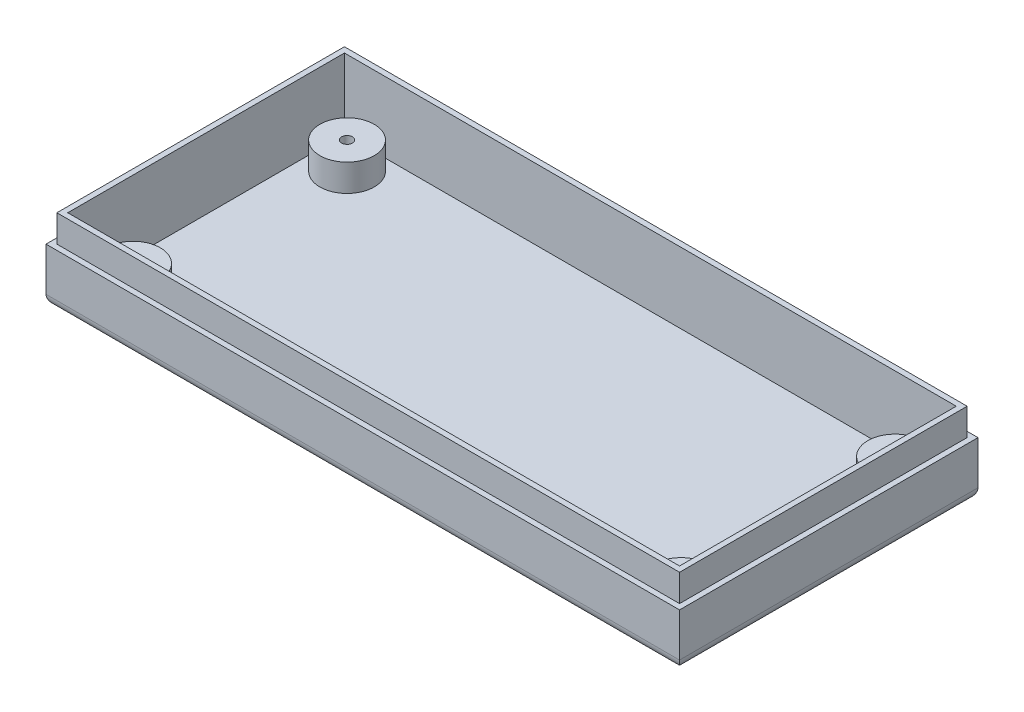
ISO-10303-21;
HEADER;
FILE_DESCRIPTION(('STEP AP214'),'2;1');
FILE_NAME('part.step','',(''),(''),'','','');
FILE_SCHEMA(('AUTOMOTIVE_DESIGN { 1 0 10303 214 1 1 1 1 }'));
ENDSEC;
DATA;
#1=APPLICATION_CONTEXT('core data for automotive mechanical design processes');
#2=APPLICATION_PROTOCOL_DEFINITION('international standard','automotive_design',2000,#1);
#3=PRODUCT_CONTEXT('',#1,'mechanical');
#4=PRODUCT('Part','Part','',(#3));
#5=PRODUCT_RELATED_PRODUCT_CATEGORY('part','',(#4));
#6=PRODUCT_DEFINITION_FORMATION('','',#4);
#7=PRODUCT_DEFINITION_CONTEXT('part definition',#1,'design');
#8=PRODUCT_DEFINITION('design','',#6,#7);
#9=PRODUCT_DEFINITION_SHAPE('','',#8);
#10=(LENGTH_UNIT() NAMED_UNIT(*) SI_UNIT(.MILLI.,.METRE.));
#11=(NAMED_UNIT(*) PLANE_ANGLE_UNIT() SI_UNIT($,.RADIAN.));
#12=(NAMED_UNIT(*) SI_UNIT($,.STERADIAN.) SOLID_ANGLE_UNIT());
#13=UNCERTAINTY_MEASURE_WITH_UNIT(LENGTH_MEASURE(1.E-05),#10,'distance_accuracy_value','');
#14=(GEOMETRIC_REPRESENTATION_CONTEXT(3) GLOBAL_UNCERTAINTY_ASSIGNED_CONTEXT((#13)) GLOBAL_UNIT_ASSIGNED_CONTEXT((#10,
#11,#12)) REPRESENTATION_CONTEXT('',''));
#15=CARTESIAN_POINT('',(0.,0.,0.));
#16=DIRECTION('',(0.,0.,1.));
#17=DIRECTION('',(1.,0.,0.));
#18=AXIS2_PLACEMENT_3D('',#15,#16,#17);
#19=CARTESIAN_POINT('',(-86.7417085427136,10.,-16.7634503002109));
#20=DIRECTION('',(1.,0.,0.));
#21=DIRECTION('',(0.,0.,-1.));
#22=AXIS2_PLACEMENT_3D('',#19,#20,#21);
#23=PLANE('',#22);
#24=DIRECTION('',(0.,-1.,0.));
#25=VECTOR('',#24,1.);
#26=CARTESIAN_POINT('',(-86.7417085427136,10.,-14.7634503002109));
#27=LINE('',#26,#25);
#28=CARTESIAN_POINT('',(-86.7417085427136,15.,-14.7634503002109));
#29=VERTEX_POINT('',#28);
#30=CARTESIAN_POINT('',(-86.7417085427136,2.,-14.7634503002109));
#31=VERTEX_POINT('',#30);
#32=EDGE_CURVE('E187',#29,#31,#27,.T.);
#33=ORIENTED_EDGE('',*,*,#32,.F.);
#34=DIRECTION('',(0.,0.,1.));
#35=VECTOR('',#34,1.);
#36=CARTESIAN_POINT('',(-86.7417085427136,15.,-14.7634503002109));
#37=LINE('',#36,#35);
#38=CARTESIAN_POINT('',(-86.7417085427136,15.,36.1615218951902));
#39=VERTEX_POINT('',#38);
#40=EDGE_CURVE('E190',#29,#39,#37,.T.);
#41=ORIENTED_EDGE('',*,*,#40,.T.);
#42=DIRECTION('',(0.,-1.,0.));
#43=VECTOR('',#42,1.);
#44=CARTESIAN_POINT('',(-86.7417085427136,10.,36.1615218951902));
#45=LINE('',#44,#43);
#46=CARTESIAN_POINT('',(-86.7417085427136,2.,36.1615218951902));
#47=VERTEX_POINT('',#46);
#48=EDGE_CURVE('E102',#39,#47,#45,.T.);
#49=ORIENTED_EDGE('',*,*,#48,.T.);
#50=DIRECTION('',(0.,0.,-1.));
#51=VECTOR('',#50,1.);
#52=CARTESIAN_POINT('',(-86.7417085427136,2.,0.));
#53=LINE('',#52,#51);
#54=EDGE_CURVE('E315',#47,#31,#53,.T.);
#55=ORIENTED_EDGE('',*,*,#54,.T.);
#56=EDGE_LOOP('',(#33,#41,#49,#55));
#57=FACE_BOUND('',#56,.T.);
#58=ADVANCED_FACE('F63',(#57),#23,.T.);
#59=CARTESIAN_POINT('',(-88.7417085427136,10.,36.1615218951902));
#60=DIRECTION('',(0.,0.,-1.));
#61=DIRECTION('',(-1.,0.,0.));
#62=AXIS2_PLACEMENT_3D('',#59,#60,#61);
#63=PLANE('',#62);
#64=ORIENTED_EDGE('',*,*,#48,.F.);
#65=DIRECTION('',(1.,0.,0.));
#66=VECTOR('',#65,1.);
#67=CARTESIAN_POINT('',(-86.7417085427136,15.,36.1615218951902));
#68=LINE('',#67,#66);
#69=CARTESIAN_POINT('',(25.8557219457893,15.,36.1615218951902));
#70=VERTEX_POINT('',#69);
#71=EDGE_CURVE('E183',#39,#70,#68,.T.);
#72=ORIENTED_EDGE('',*,*,#71,.T.);
#73=DIRECTION('',(0.,-1.,0.));
#74=VECTOR('',#73,1.);
#75=CARTESIAN_POINT('',(25.8557219457893,10.,36.1615218951902));
#76=LINE('',#75,#74);
#77=CARTESIAN_POINT('',(25.8557219457893,2.,36.1615218951902));
#78=VERTEX_POINT('',#77);
#79=EDGE_CURVE('E320',#70,#78,#76,.T.);
#80=ORIENTED_EDGE('',*,*,#79,.T.);
#81=DIRECTION('',(1.,0.,0.));
#82=VECTOR('',#81,1.);
#83=CARTESIAN_POINT('',(-88.7417085427136,2.,36.1615218951902));
#84=LINE('',#83,#82);
#85=EDGE_CURVE('E186',#47,#78,#84,.T.);
#86=ORIENTED_EDGE('',*,*,#85,.F.);
#87=EDGE_LOOP('',(#64,#72,#80,#86));
#88=FACE_BOUND('',#87,.T.);
#89=ADVANCED_FACE('F181',(#88),#63,.T.);
#90=CARTESIAN_POINT('',(25.8557219457893,10.,-16.7634503002109));
#91=DIRECTION('',(-1.,0.,0.));
#92=DIRECTION('',(0.,0.,1.));
#93=AXIS2_PLACEMENT_3D('',#90,#91,#92);
#94=PLANE('',#93);
#95=ORIENTED_EDGE('',*,*,#79,.F.);
#96=DIRECTION('',(0.,0.,-1.));
#97=VECTOR('',#96,1.);
#98=CARTESIAN_POINT('',(25.8557219457893,15.,-14.7634503002109));
#99=LINE('',#98,#97);
#100=CARTESIAN_POINT('',(25.8557219457893,15.,-14.7634503002109));
#101=VERTEX_POINT('',#100);
#102=EDGE_CURVE('E197',#70,#101,#99,.T.);
#103=ORIENTED_EDGE('',*,*,#102,.T.);
#104=DIRECTION('',(0.,-1.,0.));
#105=VECTOR('',#104,1.);
#106=CARTESIAN_POINT('',(25.8557219457893,10.,-14.7634503002109));
#107=LINE('',#106,#105);
#108=CARTESIAN_POINT('',(25.8557219457893,2.,-14.7634503002109));
#109=VERTEX_POINT('',#108);
#110=EDGE_CURVE('E317',#101,#109,#107,.T.);
#111=ORIENTED_EDGE('',*,*,#110,.T.);
#112=DIRECTION('',(0.,0.,1.));
#113=VECTOR('',#112,1.);
#114=CARTESIAN_POINT('',(25.8557219457893,2.,0.));
#115=LINE('',#114,#113);
#116=EDGE_CURVE('E310',#109,#78,#115,.T.);
#117=ORIENTED_EDGE('',*,*,#116,.T.);
#118=EDGE_LOOP('',(#95,#103,#111,#117));
#119=FACE_BOUND('',#118,.T.);
#120=ADVANCED_FACE('F361',(#119),#94,.T.);
#121=CARTESIAN_POINT('',(-88.7417085427136,10.,-14.7634503002109));
#122=DIRECTION('',(0.,0.,1.));
#123=DIRECTION('',(1.,0.,0.));
#124=AXIS2_PLACEMENT_3D('',#121,#122,#123);
#125=PLANE('',#124);
#126=ORIENTED_EDGE('',*,*,#110,.F.);
#127=DIRECTION('',(-1.,0.,0.));
#128=VECTOR('',#127,1.);
#129=CARTESIAN_POINT('',(-86.7417085427136,15.,-14.7634503002109));
#130=LINE('',#129,#128);
#131=EDGE_CURVE('E199',#101,#29,#130,.T.);
#132=ORIENTED_EDGE('',*,*,#131,.T.);
#133=ORIENTED_EDGE('',*,*,#32,.T.);
#134=DIRECTION('',(1.,0.,0.));
#135=VECTOR('',#134,1.);
#136=CARTESIAN_POINT('',(0.,2.,-14.7634503002109));
#137=LINE('',#136,#135);
#138=EDGE_CURVE('E87',#31,#109,#137,.T.);
#139=ORIENTED_EDGE('',*,*,#138,.T.);
#140=EDGE_LOOP('',(#126,#132,#133,#139));
#141=FACE_BOUND('',#140,.T.);
#142=ADVANCED_FACE('F368',(#141),#125,.T.);
#143=CARTESIAN_POINT('',(0.,2.,0.));
#144=DIRECTION('',(0.,1.,0.));
#145=DIRECTION('',(0.,0.,1.));
#146=AXIS2_PLACEMENT_3D('',#143,#144,#145);
#147=PLANE('',#146);
#148=CARTESIAN_POINT('',(-80.6418336659376,2.,-9.1439824613833));
#149=DIRECTION('',(0.,1.,0.));
#150=DIRECTION('',(0.,0.,1.));
#151=AXIS2_PLACEMENT_3D('',#148,#149,#150);
#152=CIRCLE('',#151,5.);
#153=CARTESIAN_POINT('',(-80.6418336659376,2.,-4.14398246138329));
#154=VERTEX_POINT('',#153);
#155=EDGE_CURVE('E231',#154,#154,#152,.T.);
#156=ORIENTED_EDGE('',*,*,#155,.F.);
#157=EDGE_LOOP('',(#156));
#158=FACE_BOUND('',#157,.T.);
#159=CARTESIAN_POINT('',(20.1981663340624,2.,-9.1439824613833));
#160=DIRECTION('',(0.,1.,0.));
#161=DIRECTION('',(0.,0.,1.));
#162=AXIS2_PLACEMENT_3D('',#159,#160,#161);
#163=CIRCLE('',#162,5.);
#164=CARTESIAN_POINT('',(20.1981663340624,2.,-4.14398246138329));
#165=VERTEX_POINT('',#164);
#166=EDGE_CURVE('E240',#165,#165,#163,.T.);
#167=ORIENTED_EDGE('',*,*,#166,.F.);
#168=EDGE_LOOP('',(#167));
#169=FACE_BOUND('',#168,.T.);
#170=CARTESIAN_POINT('',(20.1981663340624,2.,30.2260175386167));
#171=DIRECTION('',(0.,1.,0.));
#172=DIRECTION('',(0.,0.,1.));
#173=AXIS2_PLACEMENT_3D('',#170,#171,#172);
#174=CIRCLE('',#173,5.);
#175=CARTESIAN_POINT('',(20.1981663340624,2.,35.2260175386167));
#176=VERTEX_POINT('',#175);
#177=EDGE_CURVE('E249',#176,#176,#174,.T.);
#178=ORIENTED_EDGE('',*,*,#177,.F.);
#179=EDGE_LOOP('',(#178));
#180=FACE_BOUND('',#179,.T.);
#181=CARTESIAN_POINT('',(-80.6418336659376,2.,30.2260175386167));
#182=DIRECTION('',(0.,1.,0.));
#183=DIRECTION('',(0.,0.,1.));
#184=AXIS2_PLACEMENT_3D('',#181,#182,#183);
#185=CIRCLE('',#184,5.);
#186=CARTESIAN_POINT('',(-80.6418336659376,2.,35.2260175386167));
#187=VERTEX_POINT('',#186);
#188=EDGE_CURVE('E260',#187,#187,#185,.T.);
#189=ORIENTED_EDGE('',*,*,#188,.F.);
#190=EDGE_LOOP('',(#189));
#191=FACE_BOUND('',#190,.T.);
#192=ORIENTED_EDGE('',*,*,#85,.T.);
#193=ORIENTED_EDGE('',*,*,#116,.F.);
#194=ORIENTED_EDGE('',*,*,#138,.F.);
#195=ORIENTED_EDGE('',*,*,#54,.F.);
#196=EDGE_LOOP('',(#192,#193,#194,#195));
#197=FACE_BOUND('',#196,.T.);
#198=ADVANCED_FACE('F65',(#158,#169,#180,#191,#197),#147,.T.);
#199=CARTESIAN_POINT('',(-80.6418336659376,7.,30.2260175386167));
#200=DIRECTION('',(0.,1.,0.));
#201=DIRECTION('',(0.,0.,1.));
#202=AXIS2_PLACEMENT_3D('',#199,#200,#201);
#203=PLANE('',#202);
#204=CARTESIAN_POINT('',(-80.6418336659376,7.,30.2260175386167));
#205=DIRECTION('',(0.,1.,0.));
#206=DIRECTION('',(0.,0.,1.));
#207=AXIS2_PLACEMENT_3D('',#204,#205,#206);
#208=CIRCLE('',#207,5.);
#209=CARTESIAN_POINT('',(-80.6418336659376,7.,35.2260175386167));
#210=VERTEX_POINT('',#209);
#211=EDGE_CURVE('E261',#210,#210,#208,.T.);
#212=ORIENTED_EDGE('',*,*,#211,.T.);
#213=EDGE_LOOP('',(#212));
#214=FACE_BOUND('',#213,.T.);
#215=CARTESIAN_POINT('',(-80.6418336659376,7.,30.2260175386167));
#216=DIRECTION('',(0.,1.,0.));
#217=DIRECTION('',(0.,0.,1.));
#218=AXIS2_PLACEMENT_3D('',#215,#216,#217);
#219=CIRCLE('',#218,0.999999999999998);
#220=CARTESIAN_POINT('',(-80.6418336659376,7.,31.2260175386167));
#221=VERTEX_POINT('',#220);
#222=EDGE_CURVE('E257',#221,#221,#219,.T.);
#223=ORIENTED_EDGE('',*,*,#222,.F.);
#224=EDGE_LOOP('',(#223));
#225=FACE_BOUND('',#224,.T.);
#226=ADVANCED_FACE('F374',(#214,#225),#203,.T.);
#227=CARTESIAN_POINT('',(-80.6418336659376,7.,30.2260175386167));
#228=DIRECTION('',(0.,-1.,0.));
#229=DIRECTION('',(0.,0.,-1.));
#230=AXIS2_PLACEMENT_3D('',#227,#228,#229);
#231=CYLINDRICAL_SURFACE('',#230,5.);
#232=ORIENTED_EDGE('',*,*,#211,.F.);
#233=EDGE_LOOP('',(#232));
#234=FACE_BOUND('',#233,.T.);
#235=ORIENTED_EDGE('',*,*,#188,.T.);
#236=EDGE_LOOP('',(#235));
#237=FACE_BOUND('',#236,.T.);
#238=ADVANCED_FACE('F380',(#234,#237),#231,.T.);
#239=CARTESIAN_POINT('',(-80.6418336659376,7.,30.2260175386167));
#240=DIRECTION('',(0.,-1.,0.));
#241=DIRECTION('',(0.,0.,-1.));
#242=AXIS2_PLACEMENT_3D('',#239,#240,#241);
#243=CYLINDRICAL_SURFACE('',#242,0.999999999999998);
#244=ORIENTED_EDGE('',*,*,#222,.T.);
#245=EDGE_LOOP('',(#244));
#246=FACE_BOUND('',#245,.T.);
#247=CARTESIAN_POINT('',(-80.6418336659376,2.,30.2260175386167));
#248=DIRECTION('',(0.,1.,0.));
#249=DIRECTION('',(0.,0.,1.));
#250=AXIS2_PLACEMENT_3D('',#247,#248,#249);
#251=CIRCLE('',#250,0.999999999999998);
#252=CARTESIAN_POINT('',(-80.6418336659376,2.,31.2260175386167));
#253=VERTEX_POINT('',#252);
#254=EDGE_CURVE('E313',#253,#253,#251,.F.);
#255=ORIENTED_EDGE('',*,*,#254,.T.);
#256=EDGE_LOOP('',(#255));
#257=FACE_BOUND('',#256,.T.);
#258=ADVANCED_FACE('F387',(#246,#257),#243,.F.);
#259=ORIENTED_EDGE('',*,*,#254,.F.);
#260=EDGE_LOOP('',(#259));
#261=FACE_BOUND('',#260,.T.);
#262=ADVANCED_FACE('F352',(#261),#147,.T.);
#263=CARTESIAN_POINT('',(20.1981663340624,7.,30.2260175386167));
#264=DIRECTION('',(0.,1.,0.));
#265=DIRECTION('',(0.,0.,1.));
#266=AXIS2_PLACEMENT_3D('',#263,#264,#265);
#267=PLANE('',#266);
#268=CARTESIAN_POINT('',(20.1981663340624,7.,30.2260175386167));
#269=DIRECTION('',(0.,1.,0.));
#270=DIRECTION('',(0.,0.,1.));
#271=AXIS2_PLACEMENT_3D('',#268,#269,#270);
#272=CIRCLE('',#271,5.);
#273=CARTESIAN_POINT('',(20.1981663340624,7.,35.2260175386167));
#274=VERTEX_POINT('',#273);
#275=EDGE_CURVE('E248',#274,#274,#272,.T.);
#276=ORIENTED_EDGE('',*,*,#275,.T.);
#277=EDGE_LOOP('',(#276));
#278=FACE_BOUND('',#277,.T.);
#279=CARTESIAN_POINT('',(20.1981663340624,7.,30.2260175386167));
#280=DIRECTION('',(0.,1.,0.));
#281=DIRECTION('',(0.,0.,1.));
#282=AXIS2_PLACEMENT_3D('',#279,#280,#281);
#283=CIRCLE('',#282,1.);
#284=CARTESIAN_POINT('',(20.1981663340624,7.,31.2260175386167));
#285=VERTEX_POINT('',#284);
#286=EDGE_CURVE('E252',#285,#285,#283,.T.);
#287=ORIENTED_EDGE('',*,*,#286,.F.);
#288=EDGE_LOOP('',(#287));
#289=FACE_BOUND('',#288,.T.);
#290=ADVANCED_FACE('F386',(#278,#289),#267,.T.);
#291=CARTESIAN_POINT('',(20.1981663340624,7.,30.2260175386167));
#292=DIRECTION('',(0.,-1.,0.));
#293=DIRECTION('',(0.,0.,-1.));
#294=AXIS2_PLACEMENT_3D('',#291,#292,#293);
#295=CYLINDRICAL_SURFACE('',#294,5.);
#296=ORIENTED_EDGE('',*,*,#275,.F.);
#297=EDGE_LOOP('',(#296));
#298=FACE_BOUND('',#297,.T.);
#299=ORIENTED_EDGE('',*,*,#177,.T.);
#300=EDGE_LOOP('',(#299));
#301=FACE_BOUND('',#300,.T.);
#302=ADVANCED_FACE('F393',(#298,#301),#295,.T.);
#303=CARTESIAN_POINT('',(20.1981663340624,7.,30.2260175386167));
#304=DIRECTION('',(0.,-1.,0.));
#305=DIRECTION('',(0.,0.,-1.));
#306=AXIS2_PLACEMENT_3D('',#303,#304,#305);
#307=CYLINDRICAL_SURFACE('',#306,1.);
#308=ORIENTED_EDGE('',*,*,#286,.T.);
#309=EDGE_LOOP('',(#308));
#310=FACE_BOUND('',#309,.T.);
#311=CARTESIAN_POINT('',(20.1981663340624,2.,30.2260175386167));
#312=DIRECTION('',(0.,1.,0.));
#313=DIRECTION('',(0.,0.,1.));
#314=AXIS2_PLACEMENT_3D('',#311,#312,#313);
#315=CIRCLE('',#314,1.);
#316=CARTESIAN_POINT('',(20.1981663340624,2.,31.2260175386167));
#317=VERTEX_POINT('',#316);
#318=EDGE_CURVE('E326',#317,#317,#315,.F.);
#319=ORIENTED_EDGE('',*,*,#318,.T.);
#320=EDGE_LOOP('',(#319));
#321=FACE_BOUND('',#320,.T.);
#322=ADVANCED_FACE('F350',(#310,#321),#307,.F.);
#323=ORIENTED_EDGE('',*,*,#318,.F.);
#324=EDGE_LOOP('',(#323));
#325=FACE_BOUND('',#324,.T.);
#326=ADVANCED_FACE('F336',(#325),#147,.T.);
#327=CARTESIAN_POINT('',(20.1981663340624,7.,-9.1439824613833));
#328=DIRECTION('',(0.,1.,0.));
#329=DIRECTION('',(0.,0.,1.));
#330=AXIS2_PLACEMENT_3D('',#327,#328,#329);
#331=PLANE('',#330);
#332=CARTESIAN_POINT('',(20.1981663340624,7.,-9.1439824613833));
#333=DIRECTION('',(0.,1.,0.));
#334=DIRECTION('',(0.,0.,1.));
#335=AXIS2_PLACEMENT_3D('',#332,#333,#334);
#336=CIRCLE('',#335,5.);
#337=CARTESIAN_POINT('',(20.1981663340624,7.,-4.14398246138329));
#338=VERTEX_POINT('',#337);
#339=EDGE_CURVE('E239',#338,#338,#336,.T.);
#340=ORIENTED_EDGE('',*,*,#339,.T.);
#341=EDGE_LOOP('',(#340));
#342=FACE_BOUND('',#341,.T.);
#343=CARTESIAN_POINT('',(20.1981663340624,7.,-9.1439824613833));
#344=DIRECTION('',(0.,1.,0.));
#345=DIRECTION('',(0.,0.,1.));
#346=AXIS2_PLACEMENT_3D('',#343,#344,#345);
#347=CIRCLE('',#346,1.);
#348=CARTESIAN_POINT('',(20.1981663340624,7.,-8.14398246138329));
#349=VERTEX_POINT('',#348);
#350=EDGE_CURVE('E243',#349,#349,#347,.T.);
#351=ORIENTED_EDGE('',*,*,#350,.F.);
#352=EDGE_LOOP('',(#351));
#353=FACE_BOUND('',#352,.T.);
#354=ADVANCED_FACE('F349',(#342,#353),#331,.T.);
#355=CARTESIAN_POINT('',(20.1981663340624,7.,-9.1439824613833));
#356=DIRECTION('',(0.,-1.,0.));
#357=DIRECTION('',(0.,0.,-1.));
#358=AXIS2_PLACEMENT_3D('',#355,#356,#357);
#359=CYLINDRICAL_SURFACE('',#358,5.);
#360=ORIENTED_EDGE('',*,*,#339,.F.);
#361=EDGE_LOOP('',(#360));
#362=FACE_BOUND('',#361,.T.);
#363=ORIENTED_EDGE('',*,*,#166,.T.);
#364=EDGE_LOOP('',(#363));
#365=FACE_BOUND('',#364,.T.);
#366=ADVANCED_FACE('F345',(#362,#365),#359,.T.);
#367=CARTESIAN_POINT('',(20.1981663340624,7.,-9.1439824613833));
#368=DIRECTION('',(0.,-1.,0.));
#369=DIRECTION('',(0.,0.,-1.));
#370=AXIS2_PLACEMENT_3D('',#367,#368,#369);
#371=CYLINDRICAL_SURFACE('',#370,1.);
#372=ORIENTED_EDGE('',*,*,#350,.T.);
#373=EDGE_LOOP('',(#372));
#374=FACE_BOUND('',#373,.T.);
#375=CARTESIAN_POINT('',(20.1981663340624,2.,-9.1439824613833));
#376=DIRECTION('',(0.,1.,0.));
#377=DIRECTION('',(0.,0.,1.));
#378=AXIS2_PLACEMENT_3D('',#375,#376,#377);
#379=CIRCLE('',#378,1.);
#380=CARTESIAN_POINT('',(20.1981663340624,2.,-8.14398246138329));
#381=VERTEX_POINT('',#380);
#382=EDGE_CURVE('E71',#381,#381,#379,.F.);
#383=ORIENTED_EDGE('',*,*,#382,.T.);
#384=EDGE_LOOP('',(#383));
#385=FACE_BOUND('',#384,.T.);
#386=ADVANCED_FACE('F331',(#374,#385),#371,.F.);
#387=ORIENTED_EDGE('',*,*,#382,.F.);
#388=EDGE_LOOP('',(#387));
#389=FACE_BOUND('',#388,.T.);
#390=ADVANCED_FACE('F333',(#389),#147,.T.);
#391=CARTESIAN_POINT('',(-80.6418336659376,7.,-9.1439824613833));
#392=DIRECTION('',(0.,1.,0.));
#393=DIRECTION('',(0.,0.,1.));
#394=AXIS2_PLACEMENT_3D('',#391,#392,#393);
#395=PLANE('',#394);
#396=CARTESIAN_POINT('',(-80.6418336659376,7.,-9.1439824613833));
#397=DIRECTION('',(0.,1.,0.));
#398=DIRECTION('',(0.,0.,1.));
#399=AXIS2_PLACEMENT_3D('',#396,#397,#398);
#400=CIRCLE('',#399,5.);
#401=CARTESIAN_POINT('',(-80.6418336659376,7.,-4.14398246138329));
#402=VERTEX_POINT('',#401);
#403=EDGE_CURVE('E230',#402,#402,#400,.T.);
#404=ORIENTED_EDGE('',*,*,#403,.T.);
#405=EDGE_LOOP('',(#404));
#406=FACE_BOUND('',#405,.T.);
#407=CARTESIAN_POINT('',(-80.6418336659376,7.,-9.1439824613833));
#408=DIRECTION('',(0.,1.,0.));
#409=DIRECTION('',(0.,0.,1.));
#410=AXIS2_PLACEMENT_3D('',#407,#408,#409);
#411=CIRCLE('',#410,0.999999999999998);
#412=CARTESIAN_POINT('',(-80.6418336659376,7.,-8.1439824613833));
#413=VERTEX_POINT('',#412);
#414=EDGE_CURVE('E234',#413,#413,#411,.T.);
#415=ORIENTED_EDGE('',*,*,#414,.F.);
#416=EDGE_LOOP('',(#415));
#417=FACE_BOUND('',#416,.T.);
#418=ADVANCED_FACE('F335',(#406,#417),#395,.T.);
#419=CARTESIAN_POINT('',(-80.6418336659376,7.,-9.1439824613833));
#420=DIRECTION('',(0.,-1.,0.));
#421=DIRECTION('',(0.,0.,-1.));
#422=AXIS2_PLACEMENT_3D('',#419,#420,#421);
#423=CYLINDRICAL_SURFACE('',#422,5.);
#424=ORIENTED_EDGE('',*,*,#403,.F.);
#425=EDGE_LOOP('',(#424));
#426=FACE_BOUND('',#425,.T.);
#427=ORIENTED_EDGE('',*,*,#155,.T.);
#428=EDGE_LOOP('',(#427));
#429=FACE_BOUND('',#428,.T.);
#430=ADVANCED_FACE('F342',(#426,#429),#423,.T.);
#431=CARTESIAN_POINT('',(-80.6418336659376,7.,-9.1439824613833));
#432=DIRECTION('',(0.,-1.,0.));
#433=DIRECTION('',(0.,0.,-1.));
#434=AXIS2_PLACEMENT_3D('',#431,#432,#433);
#435=CYLINDRICAL_SURFACE('',#434,0.999999999999998);
#436=ORIENTED_EDGE('',*,*,#414,.T.);
#437=EDGE_LOOP('',(#436));
#438=FACE_BOUND('',#437,.T.);
#439=CARTESIAN_POINT('',(-80.6418336659376,2.,-9.1439824613833));
#440=DIRECTION('',(0.,1.,0.));
#441=DIRECTION('',(0.,0.,1.));
#442=AXIS2_PLACEMENT_3D('',#439,#440,#441);
#443=CIRCLE('',#442,0.999999999999998);
#444=CARTESIAN_POINT('',(-80.6418336659376,2.,-8.1439824613833));
#445=VERTEX_POINT('',#444);
#446=EDGE_CURVE('E12',#445,#445,#443,.F.);
#447=ORIENTED_EDGE('',*,*,#446,.T.);
#448=EDGE_LOOP('',(#447));
#449=FACE_BOUND('',#448,.T.);
#450=ADVANCED_FACE('F354',(#438,#449),#435,.F.);
#451=ORIENTED_EDGE('',*,*,#446,.F.);
#452=EDGE_LOOP('',(#451));
#453=FACE_BOUND('',#452,.T.);
#454=ADVANCED_FACE('F337',(#453),#147,.T.);
#455=CARTESIAN_POINT('',(0.,15.,0.));
#456=DIRECTION('',(0.,1.,0.));
#457=DIRECTION('',(0.,0.,1.));
#458=AXIS2_PLACEMENT_3D('',#455,#456,#457);
#459=PLANE('',#458);
#460=DIRECTION('',(0.,0.,1.));
#461=VECTOR('',#460,1.);
#462=CARTESIAN_POINT('',(-87.7417085427136,15.,-15.7634503002109));
#463=LINE('',#462,#461);
#464=CARTESIAN_POINT('',(-87.7417085427136,15.,-15.7634503002109));
#465=VERTEX_POINT('',#464);
#466=CARTESIAN_POINT('',(-87.7417085427136,15.,37.1615218951902));
#467=VERTEX_POINT('',#466);
#468=EDGE_CURVE('E204',#465,#467,#463,.T.);
#469=ORIENTED_EDGE('',*,*,#468,.T.);
#470=DIRECTION('',(1.,0.,0.));
#471=VECTOR('',#470,1.);
#472=CARTESIAN_POINT('',(-87.7417085427136,15.,37.1615218951902));
#473=LINE('',#472,#471);
#474=CARTESIAN_POINT('',(26.8557219457892,15.,37.1615218951902));
#475=VERTEX_POINT('',#474);
#476=EDGE_CURVE('E207',#467,#475,#473,.T.);
#477=ORIENTED_EDGE('',*,*,#476,.T.);
#478=DIRECTION('',(0.,0.,-1.));
#479=VECTOR('',#478,1.);
#480=CARTESIAN_POINT('',(26.8557219457892,15.,-15.7634503002109));
#481=LINE('',#480,#479);
#482=CARTESIAN_POINT('',(26.8557219457892,15.,-15.7634503002109));
#483=VERTEX_POINT('',#482);
#484=EDGE_CURVE('E210',#475,#483,#481,.T.);
#485=ORIENTED_EDGE('',*,*,#484,.T.);
#486=DIRECTION('',(-1.,0.,0.));
#487=VECTOR('',#486,1.);
#488=CARTESIAN_POINT('',(-87.7417085427136,15.,-15.7634503002109));
#489=LINE('',#488,#487);
#490=EDGE_CURVE('E212',#483,#465,#489,.T.);
#491=ORIENTED_EDGE('',*,*,#490,.T.);
#492=EDGE_LOOP('',(#469,#477,#485,#491));
#493=FACE_BOUND('',#492,.T.);
#494=ORIENTED_EDGE('',*,*,#71,.F.);
#495=ORIENTED_EDGE('',*,*,#40,.F.);
#496=ORIENTED_EDGE('',*,*,#131,.F.);
#497=ORIENTED_EDGE('',*,*,#102,.F.);
#498=EDGE_LOOP('',(#494,#495,#496,#497));
#499=FACE_BOUND('',#498,.T.);
#500=ADVANCED_FACE('F195',(#493,#499),#459,.T.);
#501=CARTESIAN_POINT('',(-87.7417085427136,15.,-15.7634503002109));
#502=DIRECTION('',(1.,0.,0.));
#503=DIRECTION('',(0.,0.,-1.));
#504=AXIS2_PLACEMENT_3D('',#501,#502,#503);
#505=PLANE('',#504);
#506=DIRECTION('',(0.,0.,1.));
#507=VECTOR('',#506,1.);
#508=CARTESIAN_POINT('',(-87.7417085427136,10.,-15.7634503002109));
#509=LINE('',#508,#507);
#510=CARTESIAN_POINT('',(-87.7417085427136,10.,-15.7634503002109));
#511=VERTEX_POINT('',#510);
#512=CARTESIAN_POINT('',(-87.7417085427136,10.,37.1615218951902));
#513=VERTEX_POINT('',#512);
#514=EDGE_CURVE('E203',#511,#513,#509,.T.);
#515=ORIENTED_EDGE('',*,*,#514,.T.);
#516=DIRECTION('',(0.,-1.,0.));
#517=VECTOR('',#516,1.);
#518=CARTESIAN_POINT('',(-87.7417085427136,15.,37.1615218951902));
#519=LINE('',#518,#517);
#520=EDGE_CURVE('E228',#467,#513,#519,.T.);
#521=ORIENTED_EDGE('',*,*,#520,.F.);
#522=ORIENTED_EDGE('',*,*,#468,.F.);
#523=DIRECTION('',(0.,-1.,0.));
#524=VECTOR('',#523,1.);
#525=CARTESIAN_POINT('',(-87.7417085427136,15.,-15.7634503002109));
#526=LINE('',#525,#524);
#527=EDGE_CURVE('E214',#465,#511,#526,.T.);
#528=ORIENTED_EDGE('',*,*,#527,.T.);
#529=EDGE_LOOP('',(#515,#521,#522,#528));
#530=FACE_BOUND('',#529,.T.);
#531=ADVANCED_FACE('F475',(#530),#505,.F.);
#532=CARTESIAN_POINT('',(-87.7417085427136,15.,37.1615218951902));
#533=DIRECTION('',(0.,0.,-1.));
#534=DIRECTION('',(-1.,0.,0.));
#535=AXIS2_PLACEMENT_3D('',#532,#533,#534);
#536=PLANE('',#535);
#537=DIRECTION('',(1.,0.,0.));
#538=VECTOR('',#537,1.);
#539=CARTESIAN_POINT('',(-87.7417085427136,10.,37.1615218951902));
#540=LINE('',#539,#538);
#541=CARTESIAN_POINT('',(26.8557219457892,10.,37.1615218951902));
#542=VERTEX_POINT('',#541);
#543=EDGE_CURVE('E217',#513,#542,#540,.T.);
#544=ORIENTED_EDGE('',*,*,#543,.T.);
#545=DIRECTION('',(0.,-1.,0.));
#546=VECTOR('',#545,1.);
#547=CARTESIAN_POINT('',(26.8557219457892,15.,37.1615218951902));
#548=LINE('',#547,#546);
#549=EDGE_CURVE('E225',#475,#542,#548,.T.);
#550=ORIENTED_EDGE('',*,*,#549,.F.);
#551=ORIENTED_EDGE('',*,*,#476,.F.);
#552=ORIENTED_EDGE('',*,*,#520,.T.);
#553=EDGE_LOOP('',(#544,#550,#551,#552));
#554=FACE_BOUND('',#553,.T.);
#555=ADVANCED_FACE('F466',(#554),#536,.F.);
#556=CARTESIAN_POINT('',(26.8557219457892,15.,-15.7634503002109));
#557=DIRECTION('',(-1.,0.,0.));
#558=DIRECTION('',(0.,0.,1.));
#559=AXIS2_PLACEMENT_3D('',#556,#557,#558);
#560=PLANE('',#559);
#561=DIRECTION('',(0.,0.,-1.));
#562=VECTOR('',#561,1.);
#563=CARTESIAN_POINT('',(26.8557219457892,10.,-15.7634503002109));
#564=LINE('',#563,#562);
#565=CARTESIAN_POINT('',(26.8557219457892,10.,-15.7634503002109));
#566=VERTEX_POINT('',#565);
#567=EDGE_CURVE('E219',#542,#566,#564,.T.);
#568=ORIENTED_EDGE('',*,*,#567,.T.);
#569=DIRECTION('',(0.,-1.,0.));
#570=VECTOR('',#569,1.);
#571=CARTESIAN_POINT('',(26.8557219457892,15.,-15.7634503002109));
#572=LINE('',#571,#570);
#573=EDGE_CURVE('E78',#483,#566,#572,.T.);
#574=ORIENTED_EDGE('',*,*,#573,.F.);
#575=ORIENTED_EDGE('',*,*,#484,.F.);
#576=ORIENTED_EDGE('',*,*,#549,.T.);
#577=EDGE_LOOP('',(#568,#574,#575,#576));
#578=FACE_BOUND('',#577,.T.);
#579=ADVANCED_FACE('F470',(#578),#560,.F.);
#580=CARTESIAN_POINT('',(-87.7417085427136,15.,-15.7634503002109));
#581=DIRECTION('',(0.,0.,1.));
#582=DIRECTION('',(1.,0.,0.));
#583=AXIS2_PLACEMENT_3D('',#580,#581,#582);
#584=PLANE('',#583);
#585=DIRECTION('',(-1.,0.,0.));
#586=VECTOR('',#585,1.);
#587=CARTESIAN_POINT('',(-87.7417085427136,10.,-15.7634503002109));
#588=LINE('',#587,#586);
#589=EDGE_CURVE('E208',#566,#511,#588,.T.);
#590=ORIENTED_EDGE('',*,*,#589,.T.);
#591=ORIENTED_EDGE('',*,*,#527,.F.);
#592=ORIENTED_EDGE('',*,*,#490,.F.);
#593=ORIENTED_EDGE('',*,*,#573,.T.);
#594=EDGE_LOOP('',(#590,#591,#592,#593));
#595=FACE_BOUND('',#594,.T.);
#596=ADVANCED_FACE('F416',(#595),#584,.F.);
#597=CARTESIAN_POINT('',(0.,0.,0.));
#598=DIRECTION('',(0.,1.,0.));
#599=DIRECTION('',(0.,0.,1.));
#600=AXIS2_PLACEMENT_3D('',#597,#598,#599);
#601=PLANE('',#600);
#602=DIRECTION('',(1.,0.,0.));
#603=VECTOR('',#602,1.);
#604=CARTESIAN_POINT('',(0.,0.,36.1615218951902));
#605=LINE('',#604,#603);
#606=CARTESIAN_POINT('',(25.8557219457893,0.,36.1615218951902));
#607=VERTEX_POINT('',#606);
#608=CARTESIAN_POINT('',(-86.7417085427136,0.,36.1615218951902));
#609=VERTEX_POINT('',#608);
#610=EDGE_CURVE('E289',#607,#609,#605,.F.);
#611=ORIENTED_EDGE('',*,*,#610,.T.);
#612=DIRECTION('',(0.,0.,1.));
#613=VECTOR('',#612,1.);
#614=CARTESIAN_POINT('',(-86.7417085427136,0.,0.));
#615=LINE('',#614,#613);
#616=CARTESIAN_POINT('',(-86.7417085427136,0.,-14.7634503002109));
#617=VERTEX_POINT('',#616);
#618=EDGE_CURVE('E295',#609,#617,#615,.F.);
#619=ORIENTED_EDGE('',*,*,#618,.T.);
#620=DIRECTION('',(-1.,0.,0.));
#621=VECTOR('',#620,1.);
#622=CARTESIAN_POINT('',(0.,0.,-14.7634503002109));
#623=LINE('',#622,#621);
#624=CARTESIAN_POINT('',(25.8557219457893,0.,-14.7634503002109));
#625=VERTEX_POINT('',#624);
#626=EDGE_CURVE('E293',#617,#625,#623,.F.);
#627=ORIENTED_EDGE('',*,*,#626,.T.);
#628=DIRECTION('',(0.,0.,-1.));
#629=VECTOR('',#628,1.);
#630=CARTESIAN_POINT('',(25.8557219457893,0.,0.));
#631=LINE('',#630,#629);
#632=EDGE_CURVE('E291',#625,#607,#631,.F.);
#633=ORIENTED_EDGE('',*,*,#632,.T.);
#634=EDGE_LOOP('',(#611,#619,#627,#633));
#635=FACE_BOUND('',#634,.T.);
#636=ADVANCED_FACE('F412',(#635),#601,.F.);
#637=CARTESIAN_POINT('',(-88.7417085427136,2.,-14.7634503002109));
#638=DIRECTION('',(-1.,0.,0.));
#639=DIRECTION('',(0.,0.,1.));
#640=AXIS2_PLACEMENT_3D('',#637,#638,#639);
#641=CYLINDRICAL_SURFACE('',#640,2.);
#642=CARTESIAN_POINT('',(25.8557219457893,2.,-14.7634503002109));
#643=DIRECTION('',(-0.707106781186547,0.,-0.707106781186547));
#644=DIRECTION('',(0.707106781186547,0.,-0.707106781186547));
#645=AXIS2_PLACEMENT_3D('',#642,#643,#644);
#646=ELLIPSE('',#645,2.82842712474619,2.);
#647=CARTESIAN_POINT('',(27.8557219457893,2.,-16.7634503002109));
#648=VERTEX_POINT('',#647);
#649=EDGE_CURVE('E271',#648,#625,#646,.T.);
#650=ORIENTED_EDGE('',*,*,#649,.T.);
#651=ORIENTED_EDGE('',*,*,#626,.F.);
#652=CARTESIAN_POINT('',(-86.7417085427136,2.,-14.7634503002109));
#653=DIRECTION('',(-0.707106781186548,0.,0.707106781186547));
#654=DIRECTION('',(-0.707106781186547,0.,-0.707106781186548));
#655=AXIS2_PLACEMENT_3D('',#652,#653,#654);
#656=ELLIPSE('',#655,2.82842712474619,2.);
#657=CARTESIAN_POINT('',(-88.7417085427136,2.,-16.7634503002109));
#658=VERTEX_POINT('',#657);
#659=EDGE_CURVE('E303',#658,#617,#656,.T.);
#660=ORIENTED_EDGE('',*,*,#659,.F.);
#661=DIRECTION('',(-1.,0.,0.));
#662=VECTOR('',#661,1.);
#663=CARTESIAN_POINT('',(-88.7417085427136,2.,-16.7634503002109));
#664=LINE('',#663,#662);
#665=EDGE_CURVE('E298',#648,#658,#664,.T.);
#666=ORIENTED_EDGE('',*,*,#665,.F.);
#667=EDGE_LOOP('',(#650,#651,#660,#666));
#668=FACE_BOUND('',#667,.T.);
#669=ADVANCED_FACE('F415',(#668),#641,.T.);
#670=CARTESIAN_POINT('',(25.8557219457893,2.,-16.7634503002109));
#671=DIRECTION('',(0.,0.,-1.));
#672=DIRECTION('',(-1.,0.,0.));
#673=AXIS2_PLACEMENT_3D('',#670,#671,#672);
#674=CYLINDRICAL_SURFACE('',#673,2.);
#675=CARTESIAN_POINT('',(25.8557219457893,2.,36.1615218951902));
#676=DIRECTION('',(0.707106781186547,0.,-0.707106781186547));
#677=DIRECTION('',(0.707106781186547,0.,0.707106781186547));
#678=AXIS2_PLACEMENT_3D('',#675,#676,#677);
#679=ELLIPSE('',#678,2.82842712474619,2.);
#680=CARTESIAN_POINT('',(27.8557219457893,2.,38.1615218951902));
#681=VERTEX_POINT('',#680);
#682=EDGE_CURVE('E305',#607,#681,#679,.F.);
#683=ORIENTED_EDGE('',*,*,#682,.F.);
#684=ORIENTED_EDGE('',*,*,#632,.F.);
#685=ORIENTED_EDGE('',*,*,#649,.F.);
#686=DIRECTION('',(0.,0.,-1.));
#687=VECTOR('',#686,1.);
#688=CARTESIAN_POINT('',(27.8557219457893,2.,-16.7634503002109));
#689=LINE('',#688,#687);
#690=EDGE_CURVE('E117',#681,#648,#689,.T.);
#691=ORIENTED_EDGE('',*,*,#690,.F.);
#692=EDGE_LOOP('',(#683,#684,#685,#691));
#693=FACE_BOUND('',#692,.T.);
#694=ADVANCED_FACE('F364',(#693),#674,.T.);
#695=CARTESIAN_POINT('',(-88.7417085427136,2.,36.1615218951902));
#696=DIRECTION('',(1.,0.,0.));
#697=DIRECTION('',(0.,0.,-1.));
#698=AXIS2_PLACEMENT_3D('',#695,#696,#697);
#699=CYLINDRICAL_SURFACE('',#698,2.);
#700=ORIENTED_EDGE('',*,*,#682,.T.);
#701=DIRECTION('',(1.,0.,0.));
#702=VECTOR('',#701,1.);
#703=CARTESIAN_POINT('',(-88.7417085427136,2.,38.1615218951902));
#704=LINE('',#703,#702);
#705=CARTESIAN_POINT('',(-88.7417085427136,2.,38.1615218951902));
#706=VERTEX_POINT('',#705);
#707=EDGE_CURVE('E110',#706,#681,#704,.T.);
#708=ORIENTED_EDGE('',*,*,#707,.F.);
#709=CARTESIAN_POINT('',(-86.7417085427136,2.,36.1615218951902));
#710=DIRECTION('',(0.707106781186547,0.,0.707106781186548));
#711=DIRECTION('',(0.707106781186548,0.,-0.707106781186547));
#712=AXIS2_PLACEMENT_3D('',#709,#710,#711);
#713=ELLIPSE('',#712,2.82842712474619,2.);
#714=EDGE_CURVE('E264',#609,#706,#713,.F.);
#715=ORIENTED_EDGE('',*,*,#714,.F.);
#716=ORIENTED_EDGE('',*,*,#610,.F.);
#717=EDGE_LOOP('',(#700,#708,#715,#716));
#718=FACE_BOUND('',#717,.T.);
#719=ADVANCED_FACE('F434',(#718),#699,.T.);
#720=CARTESIAN_POINT('',(-86.7417085427136,2.,-16.7634503002109));
#721=DIRECTION('',(0.,0.,1.));
#722=DIRECTION('',(1.,0.,0.));
#723=AXIS2_PLACEMENT_3D('',#720,#721,#722);
#724=CYLINDRICAL_SURFACE('',#723,2.);
#725=ORIENTED_EDGE('',*,*,#659,.T.);
#726=ORIENTED_EDGE('',*,*,#618,.F.);
#727=ORIENTED_EDGE('',*,*,#714,.T.);
#728=DIRECTION('',(0.,0.,1.));
#729=VECTOR('',#728,1.);
#730=CARTESIAN_POINT('',(-88.7417085427136,2.,-16.7634503002109));
#731=LINE('',#730,#729);
#732=EDGE_CURVE('E286',#658,#706,#731,.T.);
#733=ORIENTED_EDGE('',*,*,#732,.F.);
#734=EDGE_LOOP('',(#725,#726,#727,#733));
#735=FACE_BOUND('',#734,.T.);
#736=ADVANCED_FACE('F422',(#735),#724,.T.);
#737=CARTESIAN_POINT('',(-88.7417085427136,10.,-16.7634503002109));
#738=DIRECTION('',(0.,0.,1.));
#739=DIRECTION('',(1.,0.,0.));
#740=AXIS2_PLACEMENT_3D('',#737,#738,#739);
#741=PLANE('',#740);
#742=DIRECTION('',(0.,-1.,0.));
#743=VECTOR('',#742,1.);
#744=CARTESIAN_POINT('',(27.8557219457893,10.,-16.7634503002109));
#745=LINE('',#744,#743);
#746=CARTESIAN_POINT('',(27.8557219457893,10.,-16.7634503002109));
#747=VERTEX_POINT('',#746);
#748=EDGE_CURVE('E280',#747,#648,#745,.T.);
#749=ORIENTED_EDGE('',*,*,#748,.T.);
#750=ORIENTED_EDGE('',*,*,#665,.T.);
#751=DIRECTION('',(0.,-1.,0.));
#752=VECTOR('',#751,1.);
#753=CARTESIAN_POINT('',(-88.7417085427136,10.,-16.7634503002109));
#754=LINE('',#753,#752);
#755=CARTESIAN_POINT('',(-88.7417085427136,10.,-16.7634503002109));
#756=VERTEX_POINT('',#755);
#757=EDGE_CURVE('E277',#756,#658,#754,.T.);
#758=ORIENTED_EDGE('',*,*,#757,.F.);
#759=DIRECTION('',(-1.,0.,0.));
#760=VECTOR('',#759,1.);
#761=CARTESIAN_POINT('',(-88.7417085427136,10.,-16.7634503002109));
#762=LINE('',#761,#760);
#763=EDGE_CURVE('E275',#747,#756,#762,.T.);
#764=ORIENTED_EDGE('',*,*,#763,.F.);
#765=EDGE_LOOP('',(#749,#750,#758,#764));
#766=FACE_BOUND('',#765,.T.);
#767=ADVANCED_FACE('F418',(#766),#741,.F.);
#768=CARTESIAN_POINT('',(27.8557219457893,10.,-16.7634503002109));
#769=DIRECTION('',(-1.,0.,0.));
#770=DIRECTION('',(0.,0.,1.));
#771=AXIS2_PLACEMENT_3D('',#768,#769,#770);
#772=PLANE('',#771);
#773=DIRECTION('',(0.,-1.,0.));
#774=VECTOR('',#773,1.);
#775=CARTESIAN_POINT('',(27.8557219457893,10.,38.1615218951902));
#776=LINE('',#775,#774);
#777=CARTESIAN_POINT('',(27.8557219457893,10.,38.1615218951902));
#778=VERTEX_POINT('',#777);
#779=EDGE_CURVE('E282',#778,#681,#776,.T.);
#780=ORIENTED_EDGE('',*,*,#779,.T.);
#781=ORIENTED_EDGE('',*,*,#690,.T.);
#782=ORIENTED_EDGE('',*,*,#748,.F.);
#783=DIRECTION('',(0.,0.,-1.));
#784=VECTOR('',#783,1.);
#785=CARTESIAN_POINT('',(27.8557219457893,10.,-16.7634503002109));
#786=LINE('',#785,#784);
#787=EDGE_CURVE('E273',#778,#747,#786,.T.);
#788=ORIENTED_EDGE('',*,*,#787,.F.);
#789=EDGE_LOOP('',(#780,#781,#782,#788));
#790=FACE_BOUND('',#789,.T.);
#791=ADVANCED_FACE('F421',(#790),#772,.F.);
#792=CARTESIAN_POINT('',(-88.7417085427136,10.,38.1615218951902));
#793=DIRECTION('',(0.,0.,-1.));
#794=DIRECTION('',(-1.,0.,0.));
#795=AXIS2_PLACEMENT_3D('',#792,#793,#794);
#796=PLANE('',#795);
#797=DIRECTION('',(0.,-1.,0.));
#798=VECTOR('',#797,1.);
#799=CARTESIAN_POINT('',(-88.7417085427136,10.,38.1615218951902));
#800=LINE('',#799,#798);
#801=CARTESIAN_POINT('',(-88.7417085427136,10.,38.1615218951902));
#802=VERTEX_POINT('',#801);
#803=EDGE_CURVE('E284',#802,#706,#800,.T.);
#804=ORIENTED_EDGE('',*,*,#803,.T.);
#805=ORIENTED_EDGE('',*,*,#707,.T.);
#806=ORIENTED_EDGE('',*,*,#779,.F.);
#807=DIRECTION('',(1.,0.,0.));
#808=VECTOR('',#807,1.);
#809=CARTESIAN_POINT('',(-88.7417085427136,10.,38.1615218951902));
#810=LINE('',#809,#808);
#811=EDGE_CURVE('E270',#802,#778,#810,.T.);
#812=ORIENTED_EDGE('',*,*,#811,.F.);
#813=EDGE_LOOP('',(#804,#805,#806,#812));
#814=FACE_BOUND('',#813,.T.);
#815=ADVANCED_FACE('F426',(#814),#796,.F.);
#816=CARTESIAN_POINT('',(-88.7417085427136,10.,-16.7634503002109));
#817=DIRECTION('',(1.,0.,0.));
#818=DIRECTION('',(0.,0.,-1.));
#819=AXIS2_PLACEMENT_3D('',#816,#817,#818);
#820=PLANE('',#819);
#821=ORIENTED_EDGE('',*,*,#757,.T.);
#822=ORIENTED_EDGE('',*,*,#732,.T.);
#823=ORIENTED_EDGE('',*,*,#803,.F.);
#824=DIRECTION('',(0.,0.,1.));
#825=VECTOR('',#824,1.);
#826=CARTESIAN_POINT('',(-88.7417085427136,10.,-16.7634503002109));
#827=LINE('',#826,#825);
#828=EDGE_CURVE('E267',#756,#802,#827,.T.);
#829=ORIENTED_EDGE('',*,*,#828,.F.);
#830=EDGE_LOOP('',(#821,#822,#823,#829));
#831=FACE_BOUND('',#830,.T.);
#832=ADVANCED_FACE('F410',(#831),#820,.F.);
#833=CARTESIAN_POINT('',(0.,10.,0.));
#834=DIRECTION('',(0.,1.,0.));
#835=DIRECTION('',(0.,0.,1.));
#836=AXIS2_PLACEMENT_3D('',#833,#834,#835);
#837=PLANE('',#836);
#838=ORIENTED_EDGE('',*,*,#828,.T.);
#839=ORIENTED_EDGE('',*,*,#811,.T.);
#840=ORIENTED_EDGE('',*,*,#787,.T.);
#841=ORIENTED_EDGE('',*,*,#763,.T.);
#842=EDGE_LOOP('',(#838,#839,#840,#841));
#843=FACE_BOUND('',#842,.T.);
#844=ORIENTED_EDGE('',*,*,#543,.F.);
#845=ORIENTED_EDGE('',*,*,#514,.F.);
#846=ORIENTED_EDGE('',*,*,#589,.F.);
#847=ORIENTED_EDGE('',*,*,#567,.F.);
#848=EDGE_LOOP('',(#844,#845,#846,#847));
#849=FACE_BOUND('',#848,.T.);
#850=ADVANCED_FACE('F407',(#843,#849),#837,.T.);
#851=CLOSED_SHELL('',(#58,#89,#120,#142,#198,#226,#238,#258,#262,#290,#302,#322,#326,#354,#366,
#386,#390,#418,#430,#450,#454,#500,#531,#555,#579,#596,#636,#669,#694,#719,#736,#767,#791,#815,
#832,#850));
#852=MANIFOLD_SOLID_BREP('B2',#851);
#853=ADVANCED_BREP_SHAPE_REPRESENTATION('',(#18,#852),#14);
#854=SHAPE_DEFINITION_REPRESENTATION(#9,#853);
ENDSEC;
END-ISO-10303-21;
